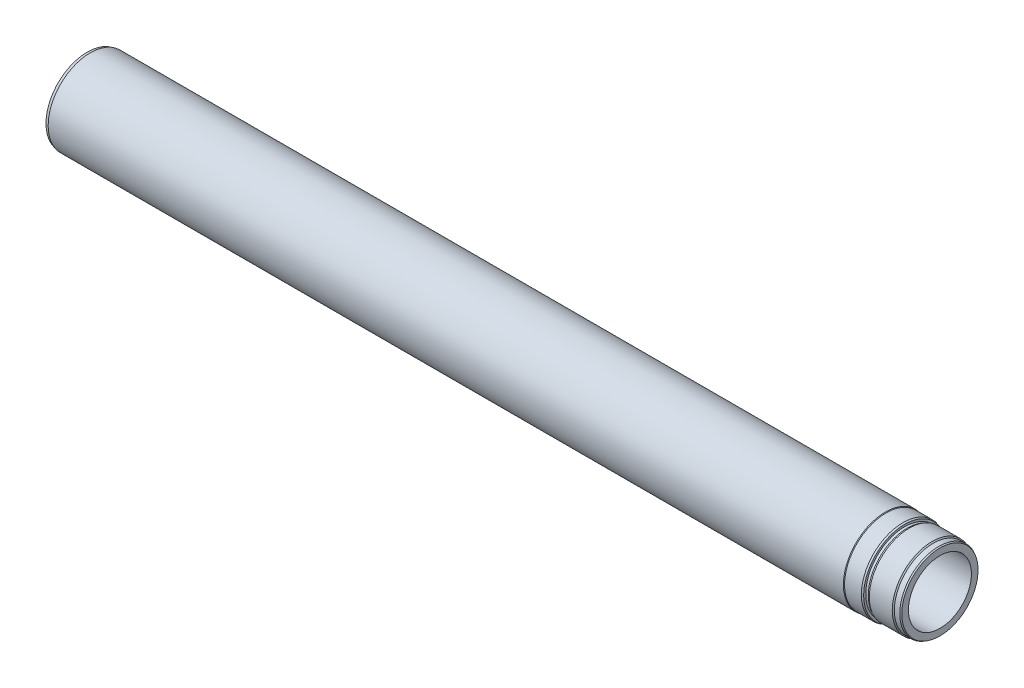
ISO-10303-21;
HEADER;
FILE_DESCRIPTION(('STEP AP214'),'2;1');
FILE_NAME('part.step','',(''),(''),'','','');
FILE_SCHEMA(('AUTOMOTIVE_DESIGN { 1 0 10303 214 1 1 1 1 }'));
ENDSEC;
DATA;
#1=APPLICATION_CONTEXT('core data for automotive mechanical design processes');
#2=APPLICATION_PROTOCOL_DEFINITION('international standard','automotive_design',2000,#1);
#3=PRODUCT_CONTEXT('',#1,'mechanical');
#4=PRODUCT('Part','Part','',(#3));
#5=PRODUCT_RELATED_PRODUCT_CATEGORY('part','',(#4));
#6=PRODUCT_DEFINITION_FORMATION('','',#4);
#7=PRODUCT_DEFINITION_CONTEXT('part definition',#1,'design');
#8=PRODUCT_DEFINITION('design','',#6,#7);
#9=PRODUCT_DEFINITION_SHAPE('','',#8);
#10=(LENGTH_UNIT() NAMED_UNIT(*) SI_UNIT(.MILLI.,.METRE.));
#11=(NAMED_UNIT(*) PLANE_ANGLE_UNIT() SI_UNIT($,.RADIAN.));
#12=(NAMED_UNIT(*) SI_UNIT($,.STERADIAN.) SOLID_ANGLE_UNIT());
#13=UNCERTAINTY_MEASURE_WITH_UNIT(LENGTH_MEASURE(1.E-05),#10,'distance_accuracy_value','');
#14=(GEOMETRIC_REPRESENTATION_CONTEXT(3) GLOBAL_UNCERTAINTY_ASSIGNED_CONTEXT((#13)) GLOBAL_UNIT_ASSIGNED_CONTEXT((#10,
#11,#12)) REPRESENTATION_CONTEXT('',''));
#15=CARTESIAN_POINT('',(0.,0.,0.));
#16=DIRECTION('',(0.,0.,1.));
#17=DIRECTION('',(1.,0.,0.));
#18=AXIS2_PLACEMENT_3D('',#15,#16,#17);
#19=CARTESIAN_POINT('',(-42.,0.,0.));
#20=DIRECTION('',(-1.,0.,0.));
#21=DIRECTION('',(0.,0.,1.));
#22=AXIS2_PLACEMENT_3D('',#19,#20,#21);
#23=CONICAL_SURFACE('',#22,48.7720595314676,0.349065850398868);
#24=CARTESIAN_POINT('',(-44.,0.,0.));
#25=DIRECTION('',(-1.,0.,0.));
#26=DIRECTION('',(0.,0.,1.));
#27=AXIS2_PLACEMENT_3D('',#24,#25,#26);
#28=CIRCLE('',#27,49.5);
#29=CARTESIAN_POINT('',(-44.,0.,49.5));
#30=VERTEX_POINT('',#29);
#31=EDGE_CURVE('E10',#30,#30,#28,.T.);
#32=ORIENTED_EDGE('',*,*,#31,.F.);
#33=EDGE_LOOP('',(#32));
#34=FACE_BOUND('',#33,.T.);
#35=CARTESIAN_POINT('',(-42.,0.,0.));
#36=DIRECTION('',(-1.,0.,0.));
#37=DIRECTION('',(0.,0.,1.));
#38=AXIS2_PLACEMENT_3D('',#35,#36,#37);
#39=CIRCLE('',#38,48.7720595314676);
#40=CARTESIAN_POINT('',(-42.,0.,48.7720595314676));
#41=VERTEX_POINT('',#40);
#42=EDGE_CURVE('E109',#41,#41,#39,.T.);
#43=ORIENTED_EDGE('',*,*,#42,.T.);
#44=EDGE_LOOP('',(#43));
#45=FACE_BOUND('',#44,.T.);
#46=ADVANCED_FACE('F45',(#34,#45),#23,.T.);
#47=CARTESIAN_POINT('',(-1014.5,0.,0.));
#48=DIRECTION('',(-1.,0.,0.));
#49=DIRECTION('',(0.,0.,1.));
#50=AXIS2_PLACEMENT_3D('',#47,#48,#49);
#51=CYLINDRICAL_SURFACE('',#50,49.5);
#52=CARTESIAN_POINT('',(-64.0000000000001,0.,0.));
#53=DIRECTION('',(-1.,0.,0.));
#54=DIRECTION('',(0.,0.,1.));
#55=AXIS2_PLACEMENT_3D('',#52,#53,#54);
#56=CIRCLE('',#55,49.5);
#57=CARTESIAN_POINT('',(-64.0000000000001,0.,49.5));
#58=VERTEX_POINT('',#57);
#59=EDGE_CURVE('E51',#58,#58,#56,.T.);
#60=ORIENTED_EDGE('',*,*,#59,.F.);
#61=EDGE_LOOP('',(#60));
#62=FACE_BOUND('',#61,.T.);
#63=ORIENTED_EDGE('',*,*,#31,.T.);
#64=EDGE_LOOP('',(#63));
#65=FACE_BOUND('',#64,.T.);
#66=ADVANCED_FACE('F126',(#62,#65),#51,.T.);
#67=CARTESIAN_POINT('',(-64.0000000000001,0.,0.));
#68=DIRECTION('',(-1.,0.,0.));
#69=DIRECTION('',(0.,0.,1.));
#70=AXIS2_PLACEMENT_3D('',#67,#68,#69);
#71=CONICAL_SURFACE('',#70,49.5,0.523598775598297);
#72=CARTESIAN_POINT('',(-64.8660254037845,0.,0.));
#73=DIRECTION('',(-1.,0.,0.));
#74=DIRECTION('',(0.,0.,1.));
#75=AXIS2_PLACEMENT_3D('',#72,#73,#74);
#76=CIRCLE('',#75,50.);
#77=CARTESIAN_POINT('',(-64.8660254037845,0.,50.));
#78=VERTEX_POINT('',#77);
#79=EDGE_CURVE('E55',#78,#78,#76,.T.);
#80=ORIENTED_EDGE('',*,*,#79,.F.);
#81=EDGE_LOOP('',(#80));
#82=FACE_BOUND('',#81,.T.);
#83=ORIENTED_EDGE('',*,*,#59,.T.);
#84=EDGE_LOOP('',(#83));
#85=FACE_BOUND('',#84,.T.);
#86=ADVANCED_FACE('F131',(#82,#85),#71,.T.);
#87=CARTESIAN_POINT('',(-1014.5,0.,0.));
#88=DIRECTION('',(-1.,0.,0.));
#89=DIRECTION('',(0.,0.,1.));
#90=AXIS2_PLACEMENT_3D('',#87,#88,#89);
#91=CYLINDRICAL_SURFACE('',#90,50.);
#92=CARTESIAN_POINT('',(-1011.,0.,0.));
#93=DIRECTION('',(-1.,0.,0.));
#94=DIRECTION('',(0.,0.,1.));
#95=AXIS2_PLACEMENT_3D('',#92,#93,#94);
#96=CIRCLE('',#95,49.9999999999999);
#97=CARTESIAN_POINT('',(-1011.,0.,49.9999999999999));
#98=VERTEX_POINT('',#97);
#99=EDGE_CURVE('E59',#98,#98,#96,.T.);
#100=ORIENTED_EDGE('',*,*,#99,.F.);
#101=EDGE_LOOP('',(#100));
#102=FACE_BOUND('',#101,.T.);
#103=ORIENTED_EDGE('',*,*,#79,.T.);
#104=EDGE_LOOP('',(#103));
#105=FACE_BOUND('',#104,.T.);
#106=ADVANCED_FACE('F136',(#102,#105),#91,.T.);
#107=CARTESIAN_POINT('',(-1011.,0.,0.));
#108=DIRECTION('',(1.,0.,0.));
#109=DIRECTION('',(0.,0.,-1.));
#110=AXIS2_PLACEMENT_3D('',#107,#108,#109);
#111=CONICAL_SURFACE('',#110,49.9999999999999,0.26179938779915);
#112=CARTESIAN_POINT('',(-1014.5,0.,0.));
#113=DIRECTION('',(-1.,0.,0.));
#114=DIRECTION('',(0.,0.,1.));
#115=AXIS2_PLACEMENT_3D('',#112,#113,#114);
#116=CIRCLE('',#115,49.0621778264909);
#117=CARTESIAN_POINT('',(-1014.5,0.,49.0621778264909));
#118=VERTEX_POINT('',#117);
#119=EDGE_CURVE('E64',#118,#118,#116,.T.);
#120=ORIENTED_EDGE('',*,*,#119,.F.);
#121=EDGE_LOOP('',(#120));
#122=FACE_BOUND('',#121,.T.);
#123=ORIENTED_EDGE('',*,*,#99,.T.);
#124=EDGE_LOOP('',(#123));
#125=FACE_BOUND('',#124,.T.);
#126=ADVANCED_FACE('F142',(#122,#125),#111,.T.);
#127=CARTESIAN_POINT('',(-1014.5,49.0621778264909,0.));
#128=DIRECTION('',(1.,0.,0.));
#129=DIRECTION('',(0.,0.,-1.));
#130=AXIS2_PLACEMENT_3D('',#127,#128,#129);
#131=PLANE('',#130);
#132=CARTESIAN_POINT('',(-1014.5,0.,0.));
#133=DIRECTION('',(-1.,0.,0.));
#134=DIRECTION('',(0.,0.,1.));
#135=AXIS2_PLACEMENT_3D('',#132,#133,#134);
#136=CIRCLE('',#135,41.7499999999999);
#137=CARTESIAN_POINT('',(-1014.5,0.,41.7499999999999));
#138=VERTEX_POINT('',#137);
#139=EDGE_CURVE('E67',#138,#138,#136,.T.);
#140=ORIENTED_EDGE('',*,*,#139,.F.);
#141=EDGE_LOOP('',(#140));
#142=FACE_BOUND('',#141,.T.);
#143=ORIENTED_EDGE('',*,*,#119,.T.);
#144=EDGE_LOOP('',(#143));
#145=FACE_BOUND('',#144,.T.);
#146=ADVANCED_FACE('F146',(#142,#145),#131,.F.);
#147=CARTESIAN_POINT('',(-1014.5,0.,0.));
#148=DIRECTION('',(-1.,0.,0.));
#149=DIRECTION('',(0.,0.,1.));
#150=AXIS2_PLACEMENT_3D('',#147,#148,#149);
#151=CONICAL_SURFACE('',#150,41.7499999999999,0.785398163397404);
#152=CARTESIAN_POINT('',(-1013.,0.,0.));
#153=DIRECTION('',(-1.,0.,0.));
#154=DIRECTION('',(0.,0.,1.));
#155=AXIS2_PLACEMENT_3D('',#152,#153,#154);
#156=CIRCLE('',#155,40.25);
#157=CARTESIAN_POINT('',(-1013.,0.,40.25));
#158=VERTEX_POINT('',#157);
#159=EDGE_CURVE('E70',#158,#158,#156,.T.);
#160=ORIENTED_EDGE('',*,*,#159,.F.);
#161=EDGE_LOOP('',(#160));
#162=FACE_BOUND('',#161,.T.);
#163=ORIENTED_EDGE('',*,*,#139,.T.);
#164=EDGE_LOOP('',(#163));
#165=FACE_BOUND('',#164,.T.);
#166=ADVANCED_FACE('F150',(#162,#165),#151,.F.);
#167=CARTESIAN_POINT('',(-1014.5,0.,0.));
#168=DIRECTION('',(-1.,0.,0.));
#169=DIRECTION('',(0.,0.,1.));
#170=AXIS2_PLACEMENT_3D('',#167,#168,#169);
#171=CYLINDRICAL_SURFACE('',#170,40.25);
#172=CARTESIAN_POINT('',(-992.5,0.,0.));
#173=DIRECTION('',(-1.,0.,0.));
#174=DIRECTION('',(0.,0.,1.));
#175=AXIS2_PLACEMENT_3D('',#172,#173,#174);
#176=CIRCLE('',#175,40.25);
#177=CARTESIAN_POINT('',(-992.5,0.,40.25));
#178=VERTEX_POINT('',#177);
#179=EDGE_CURVE('E73',#178,#178,#176,.T.);
#180=ORIENTED_EDGE('',*,*,#179,.F.);
#181=EDGE_LOOP('',(#180));
#182=FACE_BOUND('',#181,.T.);
#183=ORIENTED_EDGE('',*,*,#159,.T.);
#184=EDGE_LOOP('',(#183));
#185=FACE_BOUND('',#184,.T.);
#186=ADVANCED_FACE('F154',(#182,#185),#171,.F.);
#187=CARTESIAN_POINT('',(-992.5,0.,0.));
#188=DIRECTION('',(-1.,0.,0.));
#189=DIRECTION('',(0.,0.,1.));
#190=AXIS2_PLACEMENT_3D('',#187,#188,#189);
#191=CONICAL_SURFACE('',#190,40.25,0.523598775598308);
#192=CARTESIAN_POINT('',(-990.192042298914,0.,0.));
#193=DIRECTION('',(-1.,0.,0.));
#194=DIRECTION('',(0.,0.,1.));
#195=AXIS2_PLACEMENT_3D('',#192,#193,#194);
#196=CIRCLE('',#195,38.9175);
#197=CARTESIAN_POINT('',(-990.192042298914,0.,38.9175));
#198=VERTEX_POINT('',#197);
#199=EDGE_CURVE('E76',#198,#198,#196,.T.);
#200=ORIENTED_EDGE('',*,*,#199,.F.);
#201=EDGE_LOOP('',(#200));
#202=FACE_BOUND('',#201,.T.);
#203=ORIENTED_EDGE('',*,*,#179,.T.);
#204=EDGE_LOOP('',(#203));
#205=FACE_BOUND('',#204,.T.);
#206=ADVANCED_FACE('F158',(#202,#205),#191,.F.);
#207=CARTESIAN_POINT('',(-1014.5,0.,0.));
#208=DIRECTION('',(-1.,0.,0.));
#209=DIRECTION('',(0.,0.,1.));
#210=AXIS2_PLACEMENT_3D('',#207,#208,#209);
#211=CYLINDRICAL_SURFACE('',#210,38.9175);
#212=CARTESIAN_POINT('',(-939.5,0.,0.));
#213=DIRECTION('',(-1.,0.,0.));
#214=DIRECTION('',(0.,0.,1.));
#215=AXIS2_PLACEMENT_3D('',#212,#213,#214);
#216=CIRCLE('',#215,38.9175);
#217=CARTESIAN_POINT('',(-939.5,0.,38.9175));
#218=VERTEX_POINT('',#217);
#219=EDGE_CURVE('E79',#218,#218,#216,.T.);
#220=ORIENTED_EDGE('',*,*,#219,.F.);
#221=EDGE_LOOP('',(#220));
#222=FACE_BOUND('',#221,.T.);
#223=ORIENTED_EDGE('',*,*,#199,.T.);
#224=EDGE_LOOP('',(#223));
#225=FACE_BOUND('',#224,.T.);
#226=ADVANCED_FACE('F162',(#222,#225),#211,.F.);
#227=CARTESIAN_POINT('',(-939.5,0.,0.));
#228=DIRECTION('',(-1.,0.,0.));
#229=DIRECTION('',(0.,0.,1.));
#230=AXIS2_PLACEMENT_3D('',#227,#228,#229);
#231=CONICAL_SURFACE('',#230,38.9175,0.174532925199434);
#232=CARTESIAN_POINT('',(-931.460958020692,0.,0.));
#233=DIRECTION('',(-1.,0.,0.));
#234=DIRECTION('',(0.,0.,1.));
#235=AXIS2_PLACEMENT_3D('',#232,#233,#234);
#236=CIRCLE('',#235,37.5);
#237=CARTESIAN_POINT('',(-931.460958020692,0.,37.5));
#238=VERTEX_POINT('',#237);
#239=EDGE_CURVE('E82',#238,#238,#236,.T.);
#240=ORIENTED_EDGE('',*,*,#239,.F.);
#241=EDGE_LOOP('',(#240));
#242=FACE_BOUND('',#241,.T.);
#243=ORIENTED_EDGE('',*,*,#219,.T.);
#244=EDGE_LOOP('',(#243));
#245=FACE_BOUND('',#244,.T.);
#246=ADVANCED_FACE('F166',(#242,#245),#231,.F.);
#247=CARTESIAN_POINT('',(-1014.5,0.,0.));
#248=DIRECTION('',(-1.,0.,0.));
#249=DIRECTION('',(0.,0.,1.));
#250=AXIS2_PLACEMENT_3D('',#247,#248,#249);
#251=CYLINDRICAL_SURFACE('',#250,37.5);
#252=CARTESIAN_POINT('',(0.,0.,0.));
#253=DIRECTION('',(-1.,0.,0.));
#254=DIRECTION('',(0.,0.,1.));
#255=AXIS2_PLACEMENT_3D('',#252,#253,#254);
#256=CIRCLE('',#255,37.5);
#257=CARTESIAN_POINT('',(0.,0.,37.5));
#258=VERTEX_POINT('',#257);
#259=EDGE_CURVE('E85',#258,#258,#256,.T.);
#260=ORIENTED_EDGE('',*,*,#259,.F.);
#261=EDGE_LOOP('',(#260));
#262=FACE_BOUND('',#261,.T.);
#263=ORIENTED_EDGE('',*,*,#239,.T.);
#264=EDGE_LOOP('',(#263));
#265=FACE_BOUND('',#264,.T.);
#266=ADVANCED_FACE('F170',(#262,#265),#251,.F.);
#267=CARTESIAN_POINT('',(0.,37.5,0.));
#268=DIRECTION('',(-1.,0.,0.));
#269=DIRECTION('',(0.,0.,1.));
#270=AXIS2_PLACEMENT_3D('',#267,#268,#269);
#271=PLANE('',#270);
#272=CARTESIAN_POINT('',(0.,0.,0.));
#273=DIRECTION('',(-1.,0.,0.));
#274=DIRECTION('',(0.,0.,1.));
#275=AXIS2_PLACEMENT_3D('',#272,#273,#274);
#276=CIRCLE('',#275,45.3839745962156);
#277=CARTESIAN_POINT('',(0.,0.,45.3839745962156));
#278=VERTEX_POINT('',#277);
#279=EDGE_CURVE('E88',#278,#278,#276,.T.);
#280=ORIENTED_EDGE('',*,*,#279,.F.);
#281=EDGE_LOOP('',(#280));
#282=FACE_BOUND('',#281,.T.);
#283=ORIENTED_EDGE('',*,*,#259,.T.);
#284=EDGE_LOOP('',(#283));
#285=FACE_BOUND('',#284,.T.);
#286=ADVANCED_FACE('F174',(#282,#285),#271,.F.);
#287=CARTESIAN_POINT('',(-1.50000000000006,0.,0.));
#288=DIRECTION('',(-1.,0.,0.));
#289=DIRECTION('',(0.,0.,1.));
#290=AXIS2_PLACEMENT_3D('',#287,#288,#289);
#291=CONICAL_SURFACE('',#290,46.25,0.523598775598278);
#292=ORIENTED_EDGE('',*,*,#279,.T.);
#293=EDGE_LOOP('',(#292));
#294=FACE_BOUND('',#293,.T.);
#295=CARTESIAN_POINT('',(-1.50000000000006,0.,0.));
#296=DIRECTION('',(-1.,0.,0.));
#297=DIRECTION('',(0.,0.,1.));
#298=AXIS2_PLACEMENT_3D('',#295,#296,#297);
#299=CIRCLE('',#298,46.25);
#300=CARTESIAN_POINT('',(-1.50000000000006,0.,46.25));
#301=VERTEX_POINT('',#300);
#302=EDGE_CURVE('E91',#301,#301,#299,.T.);
#303=ORIENTED_EDGE('',*,*,#302,.F.);
#304=EDGE_LOOP('',(#303));
#305=FACE_BOUND('',#304,.T.);
#306=ADVANCED_FACE('F178',(#294,#305),#291,.T.);
#307=CARTESIAN_POINT('',(-1014.5,0.,0.));
#308=DIRECTION('',(-1.,0.,0.));
#309=DIRECTION('',(0.,0.,1.));
#310=AXIS2_PLACEMENT_3D('',#307,#308,#309);
#311=CYLINDRICAL_SURFACE('',#310,46.25);
#312=CARTESIAN_POINT('',(-8.00000000000001,0.,0.));
#313=DIRECTION('',(-1.,0.,0.));
#314=DIRECTION('',(0.,0.,1.));
#315=AXIS2_PLACEMENT_3D('',#312,#313,#314);
#316=CIRCLE('',#315,46.25);
#317=CARTESIAN_POINT('',(-8.00000000000001,0.,46.25));
#318=VERTEX_POINT('',#317);
#319=EDGE_CURVE('E94',#318,#318,#316,.T.);
#320=ORIENTED_EDGE('',*,*,#319,.F.);
#321=EDGE_LOOP('',(#320));
#322=FACE_BOUND('',#321,.T.);
#323=ORIENTED_EDGE('',*,*,#302,.T.);
#324=EDGE_LOOP('',(#323));
#325=FACE_BOUND('',#324,.T.);
#326=ADVANCED_FACE('F182',(#322,#325),#311,.T.);
#327=CARTESIAN_POINT('',(-8.00000000000001,0.,0.));
#328=DIRECTION('',(-1.,0.,0.));
#329=DIRECTION('',(0.,0.,1.));
#330=AXIS2_PLACEMENT_3D('',#327,#328,#329);
#331=CONICAL_SURFACE('',#330,46.25,0.785398163397459);
#332=CARTESIAN_POINT('',(-9.24999999999998,0.,0.));
#333=DIRECTION('',(-1.,0.,0.));
#334=DIRECTION('',(0.,0.,1.));
#335=AXIS2_PLACEMENT_3D('',#332,#333,#334);
#336=CIRCLE('',#335,47.5);
#337=CARTESIAN_POINT('',(-9.24999999999998,0.,47.5));
#338=VERTEX_POINT('',#337);
#339=EDGE_CURVE('E97',#338,#338,#336,.T.);
#340=ORIENTED_EDGE('',*,*,#339,.F.);
#341=EDGE_LOOP('',(#340));
#342=FACE_BOUND('',#341,.T.);
#343=ORIENTED_EDGE('',*,*,#319,.T.);
#344=EDGE_LOOP('',(#343));
#345=FACE_BOUND('',#344,.T.);
#346=ADVANCED_FACE('F186',(#342,#345),#331,.T.);
#347=CARTESIAN_POINT('',(-1014.5,0.,0.));
#348=DIRECTION('',(-1.,0.,0.));
#349=DIRECTION('',(0.,0.,1.));
#350=AXIS2_PLACEMENT_3D('',#347,#348,#349);
#351=CYLINDRICAL_SURFACE('',#350,47.5);
#352=CARTESIAN_POINT('',(-36.5467368681185,0.,0.));
#353=DIRECTION('',(-1.,0.,0.));
#354=DIRECTION('',(0.,0.,1.));
#355=AXIS2_PLACEMENT_3D('',#352,#353,#354);
#356=CIRCLE('',#355,47.5);
#357=CARTESIAN_POINT('',(-36.5467368681185,0.,47.5));
#358=VERTEX_POINT('',#357);
#359=EDGE_CURVE('E100',#358,#358,#356,.T.);
#360=ORIENTED_EDGE('',*,*,#359,.F.);
#361=EDGE_LOOP('',(#360));
#362=FACE_BOUND('',#361,.T.);
#363=ORIENTED_EDGE('',*,*,#339,.T.);
#364=EDGE_LOOP('',(#363));
#365=FACE_BOUND('',#364,.T.);
#366=ADVANCED_FACE('F190',(#362,#365),#351,.T.);
#367=CARTESIAN_POINT('',(-39.,0.,0.));
#368=DIRECTION('',(1.,0.,0.));
#369=DIRECTION('',(0.,0.,-1.));
#370=AXIS2_PLACEMENT_3D('',#367,#368,#369);
#371=CONICAL_SURFACE('',#370,46.25,0.471238898038454);
#372=ORIENTED_EDGE('',*,*,#359,.T.);
#373=EDGE_LOOP('',(#372));
#374=FACE_BOUND('',#373,.T.);
#375=CARTESIAN_POINT('',(-39.,0.,0.));
#376=DIRECTION('',(-1.,0.,0.));
#377=DIRECTION('',(0.,0.,1.));
#378=AXIS2_PLACEMENT_3D('',#375,#376,#377);
#379=CIRCLE('',#378,46.25);
#380=CARTESIAN_POINT('',(-39.,0.,46.25));
#381=VERTEX_POINT('',#380);
#382=EDGE_CURVE('E103',#381,#381,#379,.T.);
#383=ORIENTED_EDGE('',*,*,#382,.F.);
#384=EDGE_LOOP('',(#383));
#385=FACE_BOUND('',#384,.T.);
#386=ADVANCED_FACE('F122',(#374,#385),#371,.T.);
#387=CARTESIAN_POINT('',(-1014.5,0.,0.));
#388=DIRECTION('',(-1.,0.,0.));
#389=DIRECTION('',(0.,0.,1.));
#390=AXIS2_PLACEMENT_3D('',#387,#388,#389);
#391=CYLINDRICAL_SURFACE('',#390,46.25);
#392=ORIENTED_EDGE('',*,*,#382,.T.);
#393=EDGE_LOOP('',(#392));
#394=FACE_BOUND('',#393,.T.);
#395=CARTESIAN_POINT('',(-42.,0.,0.));
#396=DIRECTION('',(-1.,0.,0.));
#397=DIRECTION('',(0.,0.,1.));
#398=AXIS2_PLACEMENT_3D('',#395,#396,#397);
#399=CIRCLE('',#398,46.25);
#400=CARTESIAN_POINT('',(-42.,0.,46.25));
#401=VERTEX_POINT('',#400);
#402=EDGE_CURVE('E106',#401,#401,#399,.T.);
#403=ORIENTED_EDGE('',*,*,#402,.F.);
#404=EDGE_LOOP('',(#403));
#405=FACE_BOUND('',#404,.T.);
#406=ADVANCED_FACE('F116',(#394,#405),#391,.T.);
#407=CARTESIAN_POINT('',(-42.,48.7720595314676,0.));
#408=DIRECTION('',(1.,0.,0.));
#409=DIRECTION('',(0.,0.,-1.));
#410=AXIS2_PLACEMENT_3D('',#407,#408,#409);
#411=PLANE('',#410);
#412=ORIENTED_EDGE('',*,*,#402,.T.);
#413=EDGE_LOOP('',(#412));
#414=FACE_BOUND('',#413,.T.);
#415=ORIENTED_EDGE('',*,*,#42,.F.);
#416=EDGE_LOOP('',(#415));
#417=FACE_BOUND('',#416,.T.);
#418=ADVANCED_FACE('F114',(#414,#417),#411,.T.);
#419=CLOSED_SHELL('',(#46,#66,#86,#106,#126,#146,#166,#186,#206,#226,#246,#266,#286,#306,#326,
#346,#366,#386,#406,#418));
#420=MANIFOLD_SOLID_BREP('B2',#419);
#421=ADVANCED_BREP_SHAPE_REPRESENTATION('',(#18,#420),#14);
#422=SHAPE_DEFINITION_REPRESENTATION(#9,#421);
ENDSEC;
END-ISO-10303-21;
